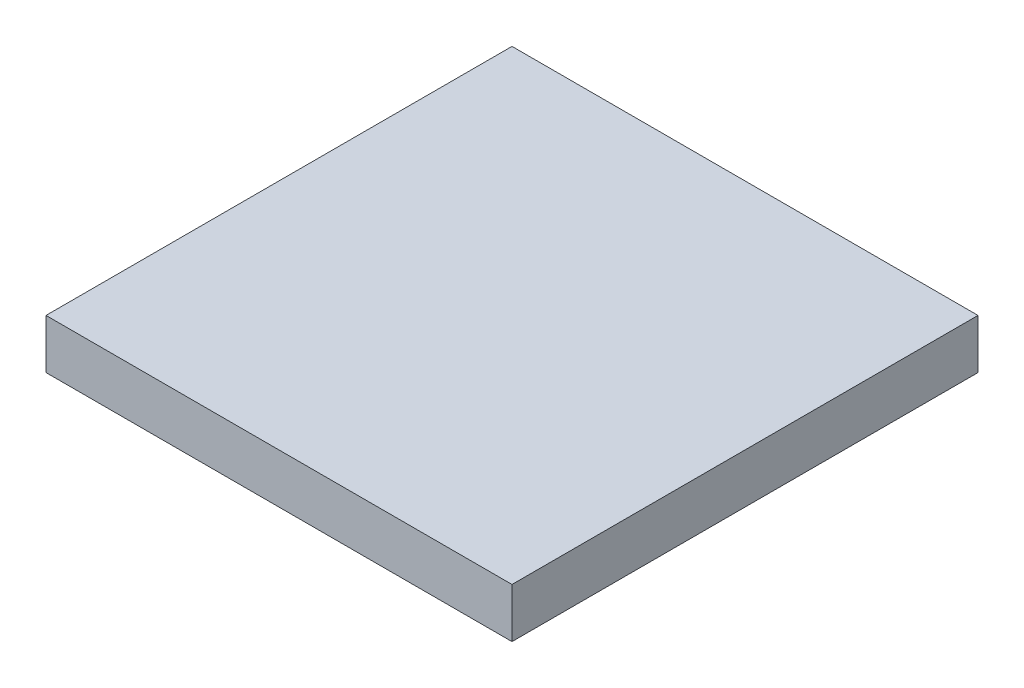
ISO-10303-21;
HEADER;
FILE_DESCRIPTION(('STEP AP214'),'2;1');
FILE_NAME('part.step','',(''),(''),'','','');
FILE_SCHEMA(('AUTOMOTIVE_DESIGN { 1 0 10303 214 1 1 1 1 }'));
ENDSEC;
DATA;
#1=APPLICATION_CONTEXT('core data for automotive mechanical design processes');
#2=APPLICATION_PROTOCOL_DEFINITION('international standard','automotive_design',2000,#1);
#3=PRODUCT_CONTEXT('',#1,'mechanical');
#4=PRODUCT('Part','Part','',(#3));
#5=PRODUCT_RELATED_PRODUCT_CATEGORY('part','',(#4));
#6=PRODUCT_DEFINITION_FORMATION('','',#4);
#7=PRODUCT_DEFINITION_CONTEXT('part definition',#1,'design');
#8=PRODUCT_DEFINITION('design','',#6,#7);
#9=PRODUCT_DEFINITION_SHAPE('','',#8);
#10=(LENGTH_UNIT() NAMED_UNIT(*) SI_UNIT(.MILLI.,.METRE.));
#11=(NAMED_UNIT(*) PLANE_ANGLE_UNIT() SI_UNIT($,.RADIAN.));
#12=(NAMED_UNIT(*) SI_UNIT($,.STERADIAN.) SOLID_ANGLE_UNIT());
#13=UNCERTAINTY_MEASURE_WITH_UNIT(LENGTH_MEASURE(1.E-05),#10,'distance_accuracy_value','');
#14=(GEOMETRIC_REPRESENTATION_CONTEXT(3) GLOBAL_UNCERTAINTY_ASSIGNED_CONTEXT((#13)) GLOBAL_UNIT_ASSIGNED_CONTEXT((#10,
#11,#12)) REPRESENTATION_CONTEXT('',''));
#15=CARTESIAN_POINT('',(0.,0.,0.));
#16=DIRECTION('',(0.,0.,1.));
#17=DIRECTION('',(1.,0.,0.));
#18=AXIS2_PLACEMENT_3D('',#15,#16,#17);
#19=CARTESIAN_POINT('',(0.,0.85,0.));
#20=DIRECTION('',(1.,0.,0.));
#21=DIRECTION('',(0.,0.,-1.));
#22=AXIS2_PLACEMENT_3D('',#19,#20,#21);
#23=PLANE('',#22);
#24=DIRECTION('',(0.,0.,1.));
#25=VECTOR('',#24,1.);
#26=CARTESIAN_POINT('',(0.,0.,0.));
#27=LINE('',#26,#25);
#28=CARTESIAN_POINT('',(0.,0.,-8.));
#29=VERTEX_POINT('',#28);
#30=CARTESIAN_POINT('',(0.,0.,0.));
#31=VERTEX_POINT('',#30);
#32=EDGE_CURVE('E97',#29,#31,#27,.T.);
#33=ORIENTED_EDGE('',*,*,#32,.T.);
#34=DIRECTION('',(0.,-1.,0.));
#35=VECTOR('',#34,1.);
#36=CARTESIAN_POINT('',(0.,0.85,0.));
#37=LINE('',#36,#35);
#38=CARTESIAN_POINT('',(0.,0.85,0.));
#39=VERTEX_POINT('',#38);
#40=EDGE_CURVE('E11',#39,#31,#37,.T.);
#41=ORIENTED_EDGE('',*,*,#40,.F.);
#42=DIRECTION('',(0.,0.,1.));
#43=VECTOR('',#42,1.);
#44=CARTESIAN_POINT('',(0.,0.85,0.));
#45=LINE('',#44,#43);
#46=CARTESIAN_POINT('',(0.,0.85,-8.));
#47=VERTEX_POINT('',#46);
#48=EDGE_CURVE('E85',#47,#39,#45,.T.);
#49=ORIENTED_EDGE('',*,*,#48,.F.);
#50=DIRECTION('',(0.,-1.,0.));
#51=VECTOR('',#50,1.);
#52=CARTESIAN_POINT('',(0.,0.85,-8.));
#53=LINE('',#52,#51);
#54=EDGE_CURVE('E93',#47,#29,#53,.T.);
#55=ORIENTED_EDGE('',*,*,#54,.T.);
#56=EDGE_LOOP('',(#33,#41,#49,#55));
#57=FACE_BOUND('',#56,.T.);
#58=ADVANCED_FACE('F34',(#57),#23,.F.);
#59=CARTESIAN_POINT('',(0.,0.85,0.));
#60=DIRECTION('',(0.,0.,-1.));
#61=DIRECTION('',(-1.,0.,0.));
#62=AXIS2_PLACEMENT_3D('',#59,#60,#61);
#63=PLANE('',#62);
#64=DIRECTION('',(1.,0.,0.));
#65=VECTOR('',#64,1.);
#66=CARTESIAN_POINT('',(0.,0.,0.));
#67=LINE('',#66,#65);
#68=CARTESIAN_POINT('',(8.,0.,0.));
#69=VERTEX_POINT('',#68);
#70=EDGE_CURVE('E89',#31,#69,#67,.T.);
#71=ORIENTED_EDGE('',*,*,#70,.T.);
#72=DIRECTION('',(0.,-1.,0.));
#73=VECTOR('',#72,1.);
#74=CARTESIAN_POINT('',(8.,0.85,0.));
#75=LINE('',#74,#73);
#76=CARTESIAN_POINT('',(8.,0.85,0.));
#77=VERTEX_POINT('',#76);
#78=EDGE_CURVE('E42',#77,#69,#75,.T.);
#79=ORIENTED_EDGE('',*,*,#78,.F.);
#80=DIRECTION('',(1.,0.,0.));
#81=VECTOR('',#80,1.);
#82=CARTESIAN_POINT('',(0.,0.85,0.));
#83=LINE('',#82,#81);
#84=EDGE_CURVE('E80',#39,#77,#83,.T.);
#85=ORIENTED_EDGE('',*,*,#84,.F.);
#86=ORIENTED_EDGE('',*,*,#40,.T.);
#87=EDGE_LOOP('',(#71,#79,#85,#86));
#88=FACE_BOUND('',#87,.T.);
#89=ADVANCED_FACE('F88',(#88),#63,.F.);
#90=CARTESIAN_POINT('',(8.,0.85,0.));
#91=DIRECTION('',(-1.,0.,0.));
#92=DIRECTION('',(0.,0.,1.));
#93=AXIS2_PLACEMENT_3D('',#90,#91,#92);
#94=PLANE('',#93);
#95=DIRECTION('',(0.,0.,-1.));
#96=VECTOR('',#95,1.);
#97=CARTESIAN_POINT('',(8.,0.,0.));
#98=LINE('',#97,#96);
#99=CARTESIAN_POINT('',(8.,0.,-8.));
#100=VERTEX_POINT('',#99);
#101=EDGE_CURVE('E67',#69,#100,#98,.T.);
#102=ORIENTED_EDGE('',*,*,#101,.T.);
#103=DIRECTION('',(0.,-1.,0.));
#104=VECTOR('',#103,1.);
#105=CARTESIAN_POINT('',(8.,0.85,-8.));
#106=LINE('',#105,#104);
#107=CARTESIAN_POINT('',(8.,0.85,-8.));
#108=VERTEX_POINT('',#107);
#109=EDGE_CURVE('E90',#108,#100,#106,.T.);
#110=ORIENTED_EDGE('',*,*,#109,.F.);
#111=DIRECTION('',(0.,0.,-1.));
#112=VECTOR('',#111,1.);
#113=CARTESIAN_POINT('',(8.,0.85,0.));
#114=LINE('',#113,#112);
#115=EDGE_CURVE('E83',#77,#108,#114,.T.);
#116=ORIENTED_EDGE('',*,*,#115,.F.);
#117=ORIENTED_EDGE('',*,*,#78,.T.);
#118=EDGE_LOOP('',(#102,#110,#116,#117));
#119=FACE_BOUND('',#118,.T.);
#120=ADVANCED_FACE('F91',(#119),#94,.F.);
#121=CARTESIAN_POINT('',(0.,0.85,-8.));
#122=DIRECTION('',(0.,0.,1.));
#123=DIRECTION('',(1.,0.,0.));
#124=AXIS2_PLACEMENT_3D('',#121,#122,#123);
#125=PLANE('',#124);
#126=DIRECTION('',(-1.,0.,0.));
#127=VECTOR('',#126,1.);
#128=CARTESIAN_POINT('',(0.,0.,-8.));
#129=LINE('',#128,#127);
#130=EDGE_CURVE('E73',#100,#29,#129,.T.);
#131=ORIENTED_EDGE('',*,*,#130,.T.);
#132=ORIENTED_EDGE('',*,*,#54,.F.);
#133=DIRECTION('',(-1.,0.,0.));
#134=VECTOR('',#133,1.);
#135=CARTESIAN_POINT('',(0.,0.85,-8.));
#136=LINE('',#135,#134);
#137=EDGE_CURVE('E50',#108,#47,#136,.T.);
#138=ORIENTED_EDGE('',*,*,#137,.F.);
#139=ORIENTED_EDGE('',*,*,#109,.T.);
#140=EDGE_LOOP('',(#131,#132,#138,#139));
#141=FACE_BOUND('',#140,.T.);
#142=ADVANCED_FACE('F104',(#141),#125,.F.);
#143=CARTESIAN_POINT('',(0.,0.85,0.));
#144=DIRECTION('',(0.,-1.,0.));
#145=DIRECTION('',(0.,0.,-1.));
#146=AXIS2_PLACEMENT_3D('',#143,#144,#145);
#147=PLANE('',#146);
#148=ORIENTED_EDGE('',*,*,#48,.T.);
#149=ORIENTED_EDGE('',*,*,#84,.T.);
#150=ORIENTED_EDGE('',*,*,#115,.T.);
#151=ORIENTED_EDGE('',*,*,#137,.T.);
#152=EDGE_LOOP('',(#148,#149,#150,#151));
#153=FACE_BOUND('',#152,.T.);
#154=ADVANCED_FACE('F81',(#153),#147,.F.);
#155=CARTESIAN_POINT('',(0.,0.,0.));
#156=DIRECTION('',(0.,-1.,0.));
#157=DIRECTION('',(0.,0.,-1.));
#158=AXIS2_PLACEMENT_3D('',#155,#156,#157);
#159=PLANE('',#158);
#160=ORIENTED_EDGE('',*,*,#32,.F.);
#161=ORIENTED_EDGE('',*,*,#130,.F.);
#162=ORIENTED_EDGE('',*,*,#101,.F.);
#163=ORIENTED_EDGE('',*,*,#70,.F.);
#164=EDGE_LOOP('',(#160,#161,#162,#163));
#165=FACE_BOUND('',#164,.T.);
#166=ADVANCED_FACE('F107',(#165),#159,.T.);
#167=CLOSED_SHELL('',(#58,#89,#120,#142,#154,#166));
#168=MANIFOLD_SOLID_BREP('B2',#167);
#169=ADVANCED_BREP_SHAPE_REPRESENTATION('',(#18,#168),#14);
#170=SHAPE_DEFINITION_REPRESENTATION(#9,#169);
ENDSEC;
END-ISO-10303-21;
